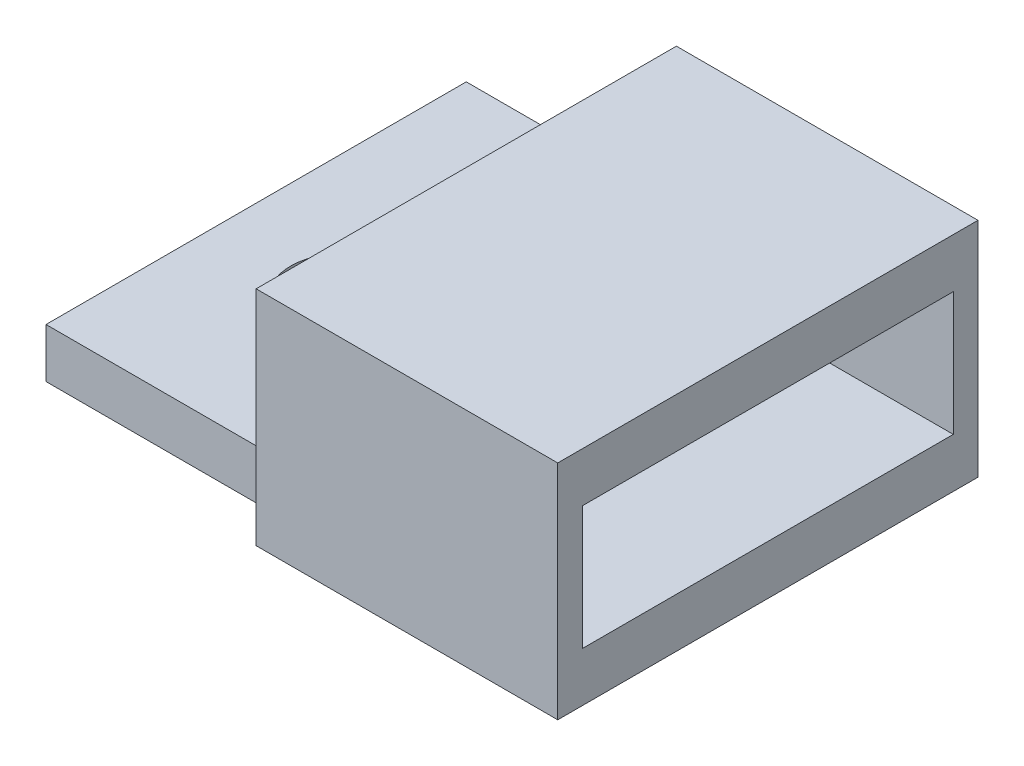
ISO-10303-21;
HEADER;
FILE_DESCRIPTION(('STEP AP214'),'2;1');
FILE_NAME('part.step','',(''),(''),'','','');
FILE_SCHEMA(('AUTOMOTIVE_DESIGN { 1 0 10303 214 1 1 1 1 }'));
ENDSEC;
DATA;
#1=APPLICATION_CONTEXT('core data for automotive mechanical design processes');
#2=APPLICATION_PROTOCOL_DEFINITION('international standard','automotive_design',2000,#1);
#3=PRODUCT_CONTEXT('',#1,'mechanical');
#4=PRODUCT('Part','Part','',(#3));
#5=PRODUCT_RELATED_PRODUCT_CATEGORY('part','',(#4));
#6=PRODUCT_DEFINITION_FORMATION('','',#4);
#7=PRODUCT_DEFINITION_CONTEXT('part definition',#1,'design');
#8=PRODUCT_DEFINITION('design','',#6,#7);
#9=PRODUCT_DEFINITION_SHAPE('','',#8);
#10=(LENGTH_UNIT() NAMED_UNIT(*) SI_UNIT(.MILLI.,.METRE.));
#11=(NAMED_UNIT(*) PLANE_ANGLE_UNIT() SI_UNIT($,.RADIAN.));
#12=(NAMED_UNIT(*) SI_UNIT($,.STERADIAN.) SOLID_ANGLE_UNIT());
#13=UNCERTAINTY_MEASURE_WITH_UNIT(LENGTH_MEASURE(1.E-05),#10,'distance_accuracy_value','');
#14=(GEOMETRIC_REPRESENTATION_CONTEXT(3) GLOBAL_UNCERTAINTY_ASSIGNED_CONTEXT((#13)) GLOBAL_UNIT_ASSIGNED_CONTEXT((#10,
#11,#12)) REPRESENTATION_CONTEXT('',''));
#15=CARTESIAN_POINT('',(0.,0.,0.));
#16=DIRECTION('',(0.,0.,1.));
#17=DIRECTION('',(1.,0.,0.));
#18=AXIS2_PLACEMENT_3D('',#15,#16,#17);
#19=CARTESIAN_POINT('',(5.,2.,0.));
#20=DIRECTION('',(-1.,0.,0.));
#21=DIRECTION('',(0.,0.,1.));
#22=AXIS2_PLACEMENT_3D('',#19,#20,#21);
#23=PLANE('',#22);
#24=DIRECTION('',(0.,-1.,0.));
#25=VECTOR('',#24,1.);
#26=CARTESIAN_POINT('',(5.,2.,-8.5));
#27=LINE('',#26,#25);
#28=CARTESIAN_POINT('',(5.,9.,-8.5));
#29=VERTEX_POINT('',#28);
#30=CARTESIAN_POINT('',(5.,2.,-8.5));
#31=VERTEX_POINT('',#30);
#32=EDGE_CURVE('E237',#29,#31,#27,.T.);
#33=ORIENTED_EDGE('',*,*,#32,.T.);
#34=DIRECTION('',(0.,0.,1.));
#35=VECTOR('',#34,1.);
#36=CARTESIAN_POINT('',(5.,2.,-10.));
#37=LINE('',#36,#35);
#38=CARTESIAN_POINT('',(5.,2.,-7.5));
#39=VERTEX_POINT('',#38);
#40=EDGE_CURVE('E167',#31,#39,#37,.T.);
#41=ORIENTED_EDGE('',*,*,#40,.T.);
#42=DIRECTION('',(0.,-1.,0.));
#43=VECTOR('',#42,1.);
#44=CARTESIAN_POINT('',(5.,0.,-7.5));
#45=LINE('',#44,#43);
#46=CARTESIAN_POINT('',(5.,7.,-7.5));
#47=VERTEX_POINT('',#46);
#48=EDGE_CURVE('E176',#47,#39,#45,.T.);
#49=ORIENTED_EDGE('',*,*,#48,.F.);
#50=DIRECTION('',(0.,0.,1.));
#51=VECTOR('',#50,1.);
#52=CARTESIAN_POINT('',(5.,7.,-8.5));
#53=LINE('',#52,#51);
#54=CARTESIAN_POINT('',(5.,7.,7.5));
#55=VERTEX_POINT('',#54);
#56=EDGE_CURVE('E183',#47,#55,#53,.T.);
#57=ORIENTED_EDGE('',*,*,#56,.T.);
#58=DIRECTION('',(0.,1.,0.));
#59=VECTOR('',#58,1.);
#60=CARTESIAN_POINT('',(5.,0.,7.5));
#61=LINE('',#60,#59);
#62=CARTESIAN_POINT('',(5.,2.,7.5));
#63=VERTEX_POINT('',#62);
#64=EDGE_CURVE('E173',#63,#55,#61,.T.);
#65=ORIENTED_EDGE('',*,*,#64,.F.);
#66=DIRECTION('',(0.,0.,1.));
#67=VECTOR('',#66,1.);
#68=CARTESIAN_POINT('',(5.,2.,0.));
#69=LINE('',#68,#67);
#70=CARTESIAN_POINT('',(5.,2.,7.));
#71=VERTEX_POINT('',#70);
#72=EDGE_CURVE('E165',#71,#63,#69,.T.);
#73=ORIENTED_EDGE('',*,*,#72,.F.);
#74=DIRECTION('',(0.,-1.,0.));
#75=VECTOR('',#74,1.);
#76=CARTESIAN_POINT('',(5.,2.,7.));
#77=LINE('',#76,#75);
#78=CARTESIAN_POINT('',(5.,0.,7.));
#79=VERTEX_POINT('',#78);
#80=EDGE_CURVE('E243',#71,#79,#77,.T.);
#81=ORIENTED_EDGE('',*,*,#80,.T.);
#82=DIRECTION('',(0.,0.,-1.));
#83=VECTOR('',#82,1.);
#84=CARTESIAN_POINT('',(5.,0.,0.));
#85=LINE('',#84,#83);
#86=CARTESIAN_POINT('',(5.,0.,8.5));
#87=VERTEX_POINT('',#86);
#88=EDGE_CURVE('E228',#87,#79,#85,.T.);
#89=ORIENTED_EDGE('',*,*,#88,.F.);
#90=DIRECTION('',(0.,-1.,0.));
#91=VECTOR('',#90,1.);
#92=CARTESIAN_POINT('',(5.,2.,8.5));
#93=LINE('',#92,#91);
#94=CARTESIAN_POINT('',(5.,9.,8.5));
#95=VERTEX_POINT('',#94);
#96=EDGE_CURVE('E240',#95,#87,#93,.T.);
#97=ORIENTED_EDGE('',*,*,#96,.F.);
#98=DIRECTION('',(0.,0.,1.));
#99=VECTOR('',#98,1.);
#100=CARTESIAN_POINT('',(5.,9.,-8.5));
#101=LINE('',#100,#99);
#102=EDGE_CURVE('E190',#29,#95,#101,.T.);
#103=ORIENTED_EDGE('',*,*,#102,.F.);
#104=EDGE_LOOP('',(#33,#41,#49,#57,#65,#73,#81,#89,#97,#103));
#105=FACE_BOUND('',#104,.T.);
#106=ADVANCED_FACE('F44',(#105),#23,.T.);
#107=CARTESIAN_POINT('',(0.,2.,7.));
#108=DIRECTION('',(0.,0.,-1.));
#109=DIRECTION('',(-1.,0.,0.));
#110=AXIS2_PLACEMENT_3D('',#107,#108,#109);
#111=PLANE('',#110);
#112=DIRECTION('',(1.,0.,0.));
#113=VECTOR('',#112,1.);
#114=CARTESIAN_POINT('',(0.,0.,7.));
#115=LINE('',#114,#113);
#116=CARTESIAN_POINT('',(-5.,0.,7.));
#117=VERTEX_POINT('',#116);
#118=EDGE_CURVE('E225',#117,#79,#115,.T.);
#119=ORIENTED_EDGE('',*,*,#118,.T.);
#120=ORIENTED_EDGE('',*,*,#80,.F.);
#121=DIRECTION('',(1.,0.,0.));
#122=VECTOR('',#121,1.);
#123=CARTESIAN_POINT('',(0.,2.,7.));
#124=LINE('',#123,#122);
#125=CARTESIAN_POINT('',(-5.,2.,7.));
#126=VERTEX_POINT('',#125);
#127=EDGE_CURVE('E217',#126,#71,#124,.T.);
#128=ORIENTED_EDGE('',*,*,#127,.F.);
#129=DIRECTION('',(0.,-1.,0.));
#130=VECTOR('',#129,1.);
#131=CARTESIAN_POINT('',(-5.,2.,7.));
#132=LINE('',#131,#130);
#133=EDGE_CURVE('E222',#126,#117,#132,.T.);
#134=ORIENTED_EDGE('',*,*,#133,.T.);
#135=EDGE_LOOP('',(#119,#120,#128,#134));
#136=FACE_BOUND('',#135,.T.);
#137=ADVANCED_FACE('F272',(#136),#111,.F.);
#138=CARTESIAN_POINT('',(0.,2.,8.5));
#139=DIRECTION('',(0.,0.,1.));
#140=DIRECTION('',(1.,0.,0.));
#141=AXIS2_PLACEMENT_3D('',#138,#139,#140);
#142=PLANE('',#141);
#143=DIRECTION('',(0.,1.,0.));
#144=VECTOR('',#143,1.);
#145=CARTESIAN_POINT('',(17.2,-2.,8.5));
#146=LINE('',#145,#144);
#147=CARTESIAN_POINT('',(17.2,0.,8.5));
#148=VERTEX_POINT('',#147);
#149=CARTESIAN_POINT('',(17.2,9.,8.5));
#150=VERTEX_POINT('',#149);
#151=EDGE_CURVE('E205',#148,#150,#146,.T.);
#152=ORIENTED_EDGE('',*,*,#151,.T.);
#153=DIRECTION('',(1.,0.,0.));
#154=VECTOR('',#153,1.);
#155=CARTESIAN_POINT('',(5.,9.,8.5));
#156=LINE('',#155,#154);
#157=EDGE_CURVE('E193',#95,#150,#156,.T.);
#158=ORIENTED_EDGE('',*,*,#157,.F.);
#159=ORIENTED_EDGE('',*,*,#96,.T.);
#160=DIRECTION('',(-1.,0.,0.));
#161=VECTOR('',#160,1.);
#162=CARTESIAN_POINT('',(0.,0.,8.5));
#163=LINE('',#162,#161);
#164=EDGE_CURVE('E231',#148,#87,#163,.T.);
#165=ORIENTED_EDGE('',*,*,#164,.F.);
#166=EDGE_LOOP('',(#152,#158,#159,#165));
#167=FACE_BOUND('',#166,.T.);
#168=ADVANCED_FACE('F277',(#167),#142,.T.);
#169=CARTESIAN_POINT('',(0.,2.,-8.5));
#170=DIRECTION('',(0.,0.,1.));
#171=DIRECTION('',(1.,0.,0.));
#172=AXIS2_PLACEMENT_3D('',#169,#170,#171);
#173=PLANE('',#172);
#174=ORIENTED_EDGE('',*,*,#32,.F.);
#175=DIRECTION('',(-1.,0.,0.));
#176=VECTOR('',#175,1.);
#177=CARTESIAN_POINT('',(5.,9.,-8.5));
#178=LINE('',#177,#176);
#179=CARTESIAN_POINT('',(17.2,9.,-8.5));
#180=VERTEX_POINT('',#179);
#181=EDGE_CURVE('E199',#180,#29,#178,.T.);
#182=ORIENTED_EDGE('',*,*,#181,.F.);
#183=DIRECTION('',(0.,1.,0.));
#184=VECTOR('',#183,1.);
#185=CARTESIAN_POINT('',(17.2,-2.,-8.5));
#186=LINE('',#185,#184);
#187=CARTESIAN_POINT('',(17.2,0.,-8.5));
#188=VERTEX_POINT('',#187);
#189=EDGE_CURVE('E202',#188,#180,#186,.T.);
#190=ORIENTED_EDGE('',*,*,#189,.F.);
#191=DIRECTION('',(-1.,0.,0.));
#192=VECTOR('',#191,1.);
#193=CARTESIAN_POINT('',(0.,0.,-8.5));
#194=LINE('',#193,#192);
#195=CARTESIAN_POINT('',(5.,0.,-8.5));
#196=VERTEX_POINT('',#195);
#197=EDGE_CURVE('E233',#188,#196,#194,.T.);
#198=ORIENTED_EDGE('',*,*,#197,.T.);
#199=DIRECTION('',(0.,-1.,0.));
#200=VECTOR('',#199,1.);
#201=CARTESIAN_POINT('',(5.,2.,-8.5));
#202=LINE('',#201,#200);
#203=EDGE_CURVE('E162',#31,#196,#202,.T.);
#204=ORIENTED_EDGE('',*,*,#203,.F.);
#205=EDGE_LOOP('',(#174,#182,#190,#198,#204));
#206=FACE_BOUND('',#205,.T.);
#207=ADVANCED_FACE('F283',(#206),#173,.F.);
#208=CARTESIAN_POINT('',(0.,2.,0.));
#209=DIRECTION('',(0.,-1.,0.));
#210=DIRECTION('',(0.,0.,-1.));
#211=AXIS2_PLACEMENT_3D('',#208,#209,#210);
#212=CYLINDRICAL_SURFACE('',#211,2.1);
#213=CARTESIAN_POINT('',(0.,2.,0.));
#214=DIRECTION('',(0.,1.,0.));
#215=DIRECTION('',(0.,0.,1.));
#216=AXIS2_PLACEMENT_3D('',#213,#214,#215);
#217=CIRCLE('',#216,2.1);
#218=CARTESIAN_POINT('',(0.,2.,2.1));
#219=VERTEX_POINT('',#218);
#220=EDGE_CURVE('E214',#219,#219,#217,.T.);
#221=ORIENTED_EDGE('',*,*,#220,.T.);
#222=EDGE_LOOP('',(#221));
#223=FACE_BOUND('',#222,.T.);
#224=CARTESIAN_POINT('',(0.,0.,0.));
#225=DIRECTION('',(0.,1.,0.));
#226=DIRECTION('',(0.,0.,1.));
#227=AXIS2_PLACEMENT_3D('',#224,#225,#226);
#228=CIRCLE('',#227,2.1);
#229=CARTESIAN_POINT('',(0.,0.,2.1));
#230=VERTEX_POINT('',#229);
#231=EDGE_CURVE('E213',#230,#230,#228,.T.);
#232=ORIENTED_EDGE('',*,*,#231,.F.);
#233=EDGE_LOOP('',(#232));
#234=FACE_BOUND('',#233,.T.);
#235=ADVANCED_FACE('F46',(#223,#234),#212,.F.);
#236=CARTESIAN_POINT('',(-5.,2.,0.));
#237=DIRECTION('',(-1.,0.,0.));
#238=DIRECTION('',(0.,0.,1.));
#239=AXIS2_PLACEMENT_3D('',#236,#237,#238);
#240=PLANE('',#239);
#241=DIRECTION('',(0.,0.,-1.));
#242=VECTOR('',#241,1.);
#243=CARTESIAN_POINT('',(-5.,0.,0.));
#244=LINE('',#243,#242);
#245=CARTESIAN_POINT('',(-5.,0.,-10.));
#246=VERTEX_POINT('',#245);
#247=EDGE_CURVE('E145',#117,#246,#244,.T.);
#248=ORIENTED_EDGE('',*,*,#247,.F.);
#249=ORIENTED_EDGE('',*,*,#133,.F.);
#250=DIRECTION('',(0.,0.,-1.));
#251=VECTOR('',#250,1.);
#252=CARTESIAN_POINT('',(-5.,2.,0.));
#253=LINE('',#252,#251);
#254=CARTESIAN_POINT('',(-5.,2.,-10.));
#255=VERTEX_POINT('',#254);
#256=EDGE_CURVE('E220',#126,#255,#253,.T.);
#257=ORIENTED_EDGE('',*,*,#256,.T.);
#258=DIRECTION('',(0.,1.,0.));
#259=VECTOR('',#258,1.);
#260=CARTESIAN_POINT('',(-5.,2.,-10.));
#261=LINE('',#260,#259);
#262=EDGE_CURVE('E149',#246,#255,#261,.T.);
#263=ORIENTED_EDGE('',*,*,#262,.F.);
#264=EDGE_LOOP('',(#248,#249,#257,#263));
#265=FACE_BOUND('',#264,.T.);
#266=ADVANCED_FACE('F281',(#265),#240,.T.);
#267=CARTESIAN_POINT('',(0.,2.,0.));
#268=DIRECTION('',(0.,1.,0.));
#269=DIRECTION('',(0.,0.,1.));
#270=AXIS2_PLACEMENT_3D('',#267,#268,#269);
#271=PLANE('',#270);
#272=DIRECTION('',(-1.,0.,0.));
#273=VECTOR('',#272,1.);
#274=CARTESIAN_POINT('',(19.,2.,-7.5));
#275=LINE('',#274,#273);
#276=CARTESIAN_POINT('',(17.2,2.,-7.5));
#277=VERTEX_POINT('',#276);
#278=EDGE_CURVE('E180',#277,#39,#275,.T.);
#279=ORIENTED_EDGE('',*,*,#278,.T.);
#280=ORIENTED_EDGE('',*,*,#40,.F.);
#281=CARTESIAN_POINT('',(5.,2.,-10.));
#282=VERTEX_POINT('',#281);
#283=EDGE_CURVE('E163',#282,#31,#37,.T.);
#284=ORIENTED_EDGE('',*,*,#283,.F.);
#285=DIRECTION('',(1.,0.,0.));
#286=VECTOR('',#285,1.);
#287=CARTESIAN_POINT('',(5.,2.,-10.));
#288=LINE('',#287,#286);
#289=EDGE_CURVE('E155',#255,#282,#288,.T.);
#290=ORIENTED_EDGE('',*,*,#289,.F.);
#291=ORIENTED_EDGE('',*,*,#256,.F.);
#292=ORIENTED_EDGE('',*,*,#127,.T.);
#293=ORIENTED_EDGE('',*,*,#72,.T.);
#294=DIRECTION('',(-1.,0.,0.));
#295=VECTOR('',#294,1.);
#296=CARTESIAN_POINT('',(19.,2.,7.5));
#297=LINE('',#296,#295);
#298=CARTESIAN_POINT('',(17.2,2.,7.5));
#299=VERTEX_POINT('',#298);
#300=EDGE_CURVE('E179',#299,#63,#297,.T.);
#301=ORIENTED_EDGE('',*,*,#300,.F.);
#302=DIRECTION('',(0.,0.,1.));
#303=VECTOR('',#302,1.);
#304=CARTESIAN_POINT('',(17.2,2.,0.));
#305=LINE('',#304,#303);
#306=EDGE_CURVE('E211',#277,#299,#305,.T.);
#307=ORIENTED_EDGE('',*,*,#306,.F.);
#308=EDGE_LOOP('',(#279,#280,#284,#290,#291,#292,#293,#301,#307));
#309=FACE_BOUND('',#308,.T.);
#310=ORIENTED_EDGE('',*,*,#220,.F.);
#311=EDGE_LOOP('',(#310));
#312=FACE_BOUND('',#311,.T.);
#313=ADVANCED_FACE('F250',(#309,#312),#271,.T.);
#314=CARTESIAN_POINT('',(0.,0.,0.));
#315=DIRECTION('',(0.,1.,0.));
#316=DIRECTION('',(0.,0.,1.));
#317=AXIS2_PLACEMENT_3D('',#314,#315,#316);
#318=PLANE('',#317);
#319=DIRECTION('',(0.,0.,1.));
#320=VECTOR('',#319,1.);
#321=CARTESIAN_POINT('',(5.,0.,-10.));
#322=LINE('',#321,#320);
#323=CARTESIAN_POINT('',(5.,0.,-10.));
#324=VERTEX_POINT('',#323);
#325=EDGE_CURVE('E141',#324,#196,#322,.T.);
#326=ORIENTED_EDGE('',*,*,#325,.T.);
#327=ORIENTED_EDGE('',*,*,#197,.F.);
#328=DIRECTION('',(0.,0.,1.));
#329=VECTOR('',#328,1.);
#330=CARTESIAN_POINT('',(17.2,0.,0.));
#331=LINE('',#330,#329);
#332=EDGE_CURVE('E207',#188,#148,#331,.T.);
#333=ORIENTED_EDGE('',*,*,#332,.T.);
#334=ORIENTED_EDGE('',*,*,#164,.T.);
#335=ORIENTED_EDGE('',*,*,#88,.T.);
#336=ORIENTED_EDGE('',*,*,#118,.F.);
#337=ORIENTED_EDGE('',*,*,#247,.T.);
#338=DIRECTION('',(-1.,0.,0.));
#339=VECTOR('',#338,1.);
#340=CARTESIAN_POINT('',(5.,0.,-10.));
#341=LINE('',#340,#339);
#342=EDGE_CURVE('E135',#324,#246,#341,.T.);
#343=ORIENTED_EDGE('',*,*,#342,.F.);
#344=EDGE_LOOP('',(#326,#327,#333,#334,#335,#336,#337,#343));
#345=FACE_BOUND('',#344,.T.);
#346=ORIENTED_EDGE('',*,*,#231,.T.);
#347=EDGE_LOOP('',(#346));
#348=FACE_BOUND('',#347,.T.);
#349=ADVANCED_FACE('F137',(#345,#348),#318,.F.);
#350=CARTESIAN_POINT('',(17.2,-2.,0.));
#351=DIRECTION('',(-1.,0.,0.));
#352=DIRECTION('',(0.,0.,1.));
#353=AXIS2_PLACEMENT_3D('',#350,#351,#352);
#354=PLANE('',#353);
#355=DIRECTION('',(0.,0.,-1.));
#356=VECTOR('',#355,1.);
#357=CARTESIAN_POINT('',(17.2,9.,-8.5));
#358=LINE('',#357,#356);
#359=EDGE_CURVE('E196',#150,#180,#358,.T.);
#360=ORIENTED_EDGE('',*,*,#359,.F.);
#361=ORIENTED_EDGE('',*,*,#151,.F.);
#362=ORIENTED_EDGE('',*,*,#332,.F.);
#363=ORIENTED_EDGE('',*,*,#189,.T.);
#364=EDGE_LOOP('',(#360,#361,#362,#363));
#365=FACE_BOUND('',#364,.T.);
#366=DIRECTION('',(0.,-1.,0.));
#367=VECTOR('',#366,1.);
#368=CARTESIAN_POINT('',(17.2,-2.,-7.5));
#369=LINE('',#368,#367);
#370=CARTESIAN_POINT('',(17.2,7.,-7.5));
#371=VERTEX_POINT('',#370);
#372=EDGE_CURVE('E11',#371,#277,#369,.T.);
#373=ORIENTED_EDGE('',*,*,#372,.T.);
#374=ORIENTED_EDGE('',*,*,#306,.T.);
#375=DIRECTION('',(0.,1.,0.));
#376=VECTOR('',#375,1.);
#377=CARTESIAN_POINT('',(17.2,-2.,7.5));
#378=LINE('',#377,#376);
#379=CARTESIAN_POINT('',(17.2,7.,7.5));
#380=VERTEX_POINT('',#379);
#381=EDGE_CURVE('E52',#299,#380,#378,.T.);
#382=ORIENTED_EDGE('',*,*,#381,.T.);
#383=DIRECTION('',(0.,0.,-1.));
#384=VECTOR('',#383,1.);
#385=CARTESIAN_POINT('',(17.2,7.,-8.5));
#386=LINE('',#385,#384);
#387=EDGE_CURVE('E58',#380,#371,#386,.T.);
#388=ORIENTED_EDGE('',*,*,#387,.T.);
#389=EDGE_LOOP('',(#373,#374,#382,#388));
#390=FACE_BOUND('',#389,.T.);
#391=ADVANCED_FACE('F245',(#365,#390),#354,.F.);
#392=CARTESIAN_POINT('',(0.,7.,0.));
#393=DIRECTION('',(0.,1.,0.));
#394=DIRECTION('',(0.,0.,1.));
#395=AXIS2_PLACEMENT_3D('',#392,#393,#394);
#396=PLANE('',#395);
#397=ORIENTED_EDGE('',*,*,#56,.F.);
#398=DIRECTION('',(-1.,0.,0.));
#399=VECTOR('',#398,1.);
#400=CARTESIAN_POINT('',(19.,7.,-7.5));
#401=LINE('',#400,#399);
#402=EDGE_CURVE('E184',#371,#47,#401,.T.);
#403=ORIENTED_EDGE('',*,*,#402,.F.);
#404=ORIENTED_EDGE('',*,*,#387,.F.);
#405=DIRECTION('',(-1.,0.,0.));
#406=VECTOR('',#405,1.);
#407=CARTESIAN_POINT('',(19.,7.,7.5));
#408=LINE('',#407,#406);
#409=EDGE_CURVE('E187',#380,#55,#408,.T.);
#410=ORIENTED_EDGE('',*,*,#409,.T.);
#411=EDGE_LOOP('',(#397,#403,#404,#410));
#412=FACE_BOUND('',#411,.T.);
#413=ADVANCED_FACE('F259',(#412),#396,.F.);
#414=CARTESIAN_POINT('',(0.,9.,0.));
#415=DIRECTION('',(0.,1.,0.));
#416=DIRECTION('',(0.,0.,1.));
#417=AXIS2_PLACEMENT_3D('',#414,#415,#416);
#418=PLANE('',#417);
#419=ORIENTED_EDGE('',*,*,#102,.T.);
#420=ORIENTED_EDGE('',*,*,#157,.T.);
#421=ORIENTED_EDGE('',*,*,#359,.T.);
#422=ORIENTED_EDGE('',*,*,#181,.T.);
#423=EDGE_LOOP('',(#419,#420,#421,#422));
#424=FACE_BOUND('',#423,.T.);
#425=ADVANCED_FACE('F261',(#424),#418,.T.);
#426=CARTESIAN_POINT('',(19.,0.,7.5));
#427=DIRECTION('',(0.,0.,1.));
#428=DIRECTION('',(1.,0.,0.));
#429=AXIS2_PLACEMENT_3D('',#426,#427,#428);
#430=PLANE('',#429);
#431=ORIENTED_EDGE('',*,*,#300,.T.);
#432=ORIENTED_EDGE('',*,*,#64,.T.);
#433=ORIENTED_EDGE('',*,*,#409,.F.);
#434=ORIENTED_EDGE('',*,*,#381,.F.);
#435=EDGE_LOOP('',(#431,#432,#433,#434));
#436=FACE_BOUND('',#435,.T.);
#437=ADVANCED_FACE('F248',(#436),#430,.F.);
#438=CARTESIAN_POINT('',(19.,0.,-7.5));
#439=DIRECTION('',(0.,0.,-1.));
#440=DIRECTION('',(0.,1.,0.));
#441=AXIS2_PLACEMENT_3D('',#438,#439,#440);
#442=PLANE('',#441);
#443=ORIENTED_EDGE('',*,*,#402,.T.);
#444=ORIENTED_EDGE('',*,*,#48,.T.);
#445=ORIENTED_EDGE('',*,*,#278,.F.);
#446=ORIENTED_EDGE('',*,*,#372,.F.);
#447=EDGE_LOOP('',(#443,#444,#445,#446));
#448=FACE_BOUND('',#447,.T.);
#449=ADVANCED_FACE('F302',(#448),#442,.F.);
#450=CARTESIAN_POINT('',(5.,2.,-10.));
#451=DIRECTION('',(-1.,0.,0.));
#452=DIRECTION('',(0.,0.,1.));
#453=AXIS2_PLACEMENT_3D('',#450,#451,#452);
#454=PLANE('',#453);
#455=ORIENTED_EDGE('',*,*,#283,.T.);
#456=ORIENTED_EDGE('',*,*,#203,.T.);
#457=ORIENTED_EDGE('',*,*,#325,.F.);
#458=DIRECTION('',(0.,-1.,0.));
#459=VECTOR('',#458,1.);
#460=CARTESIAN_POINT('',(5.,2.,-10.));
#461=LINE('',#460,#459);
#462=EDGE_CURVE('E150',#282,#324,#461,.T.);
#463=ORIENTED_EDGE('',*,*,#462,.F.);
#464=EDGE_LOOP('',(#455,#456,#457,#463));
#465=FACE_BOUND('',#464,.T.);
#466=ADVANCED_FACE('F160',(#465),#454,.F.);
#467=CARTESIAN_POINT('',(0.,0.,-10.));
#468=DIRECTION('',(0.,0.,-1.));
#469=DIRECTION('',(-1.,0.,0.));
#470=AXIS2_PLACEMENT_3D('',#467,#468,#469);
#471=PLANE('',#470);
#472=ORIENTED_EDGE('',*,*,#462,.T.);
#473=ORIENTED_EDGE('',*,*,#342,.T.);
#474=ORIENTED_EDGE('',*,*,#262,.T.);
#475=ORIENTED_EDGE('',*,*,#289,.T.);
#476=EDGE_LOOP('',(#472,#473,#474,#475));
#477=FACE_BOUND('',#476,.T.);
#478=ADVANCED_FACE('F153',(#477),#471,.T.);
#479=CLOSED_SHELL('',(#106,#137,#168,#207,#235,#266,#313,#349,#391,#413,#425,#437,#449,#466,#478));
#480=MANIFOLD_SOLID_BREP('B2',#479);
#481=ADVANCED_BREP_SHAPE_REPRESENTATION('',(#18,#480),#14);
#482=SHAPE_DEFINITION_REPRESENTATION(#9,#481);
ENDSEC;
END-ISO-10303-21;
